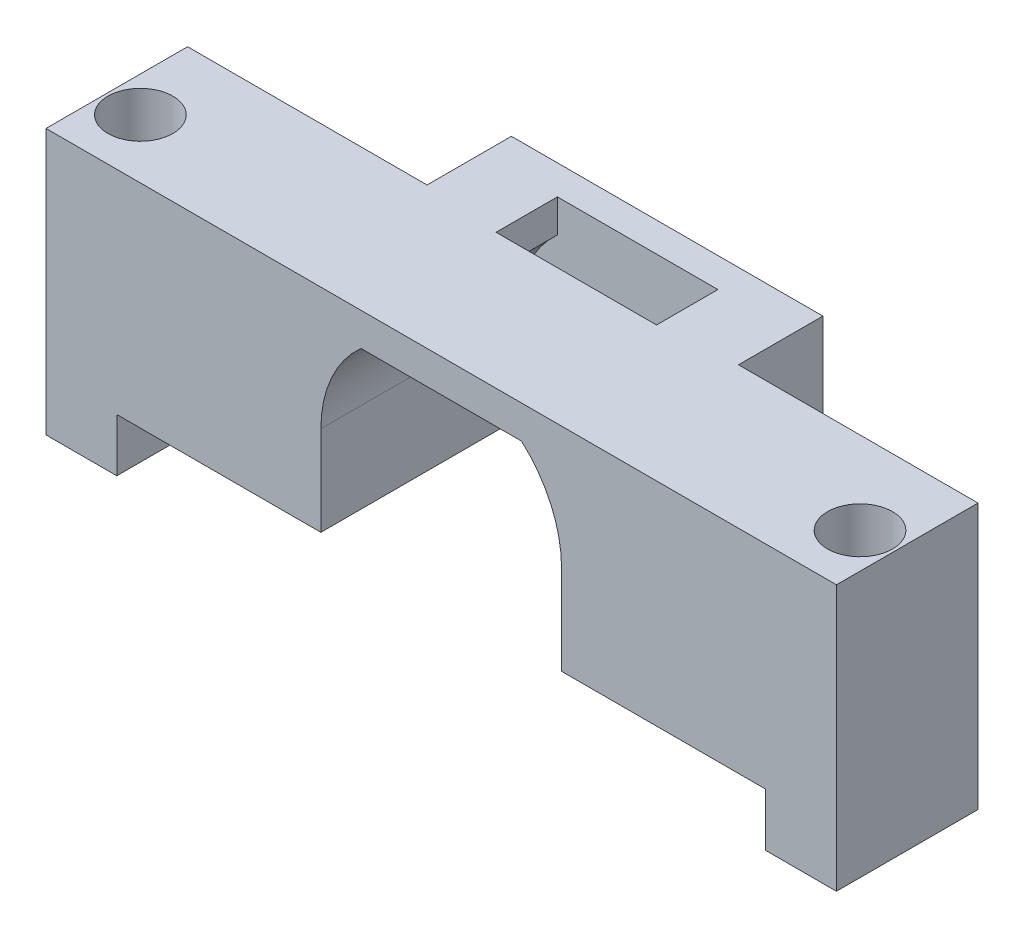
ISO-10303-21;
HEADER;
FILE_DESCRIPTION(('STEP AP214'),'2;1');
FILE_NAME('part.step','',(''),(''),'','','');
FILE_SCHEMA(('AUTOMOTIVE_DESIGN { 1 0 10303 214 1 1 1 1 }'));
ENDSEC;
DATA;
#1=APPLICATION_CONTEXT('core data for automotive mechanical design processes');
#2=APPLICATION_PROTOCOL_DEFINITION('international standard','automotive_design',2000,#1);
#3=PRODUCT_CONTEXT('',#1,'mechanical');
#4=PRODUCT('Part','Part','',(#3));
#5=PRODUCT_RELATED_PRODUCT_CATEGORY('part','',(#4));
#6=PRODUCT_DEFINITION_FORMATION('','',#4);
#7=PRODUCT_DEFINITION_CONTEXT('part definition',#1,'design');
#8=PRODUCT_DEFINITION('design','',#6,#7);
#9=PRODUCT_DEFINITION_SHAPE('','',#8);
#10=(LENGTH_UNIT() NAMED_UNIT(*) SI_UNIT(.MILLI.,.METRE.));
#11=(NAMED_UNIT(*) PLANE_ANGLE_UNIT() SI_UNIT($,.RADIAN.));
#12=(NAMED_UNIT(*) SI_UNIT($,.STERADIAN.) SOLID_ANGLE_UNIT());
#13=UNCERTAINTY_MEASURE_WITH_UNIT(LENGTH_MEASURE(1.E-05),#10,'distance_accuracy_value','');
#14=(GEOMETRIC_REPRESENTATION_CONTEXT(3) GLOBAL_UNCERTAINTY_ASSIGNED_CONTEXT((#13)) GLOBAL_UNIT_ASSIGNED_CONTEXT((#10,
#11,#12)) REPRESENTATION_CONTEXT('',''));
#15=CARTESIAN_POINT('',(0.,0.,0.));
#16=DIRECTION('',(0.,0.,1.));
#17=DIRECTION('',(1.,0.,0.));
#18=AXIS2_PLACEMENT_3D('',#15,#16,#17);
#19=CARTESIAN_POINT('',(0.,18.,12.));
#20=DIRECTION('',(0.,1.,0.));
#21=DIRECTION('',(0.,0.,1.));
#22=AXIS2_PLACEMENT_3D('',#19,#20,#21);
#23=PLANE('',#22);
#24=CARTESIAN_POINT('',(-3.,18.,7.));
#25=DIRECTION('',(0.,1.,0.));
#26=DIRECTION('',(0.,0.,1.));
#27=AXIS2_PLACEMENT_3D('',#24,#25,#26);
#28=CIRCLE('',#27,2.75);
#29=CARTESIAN_POINT('',(-3.,18.,9.75));
#30=VERTEX_POINT('',#29);
#31=EDGE_CURVE('E293',#30,#30,#28,.T.);
#32=ORIENTED_EDGE('',*,*,#31,.F.);
#33=EDGE_LOOP('',(#32));
#34=FACE_BOUND('',#33,.T.);
#35=CARTESIAN_POINT('',(58.,18.,6.99999999999999));
#36=DIRECTION('',(0.,1.,0.));
#37=DIRECTION('',(0.,0.,1.));
#38=AXIS2_PLACEMENT_3D('',#35,#36,#37);
#39=CIRCLE('',#38,2.75);
#40=CARTESIAN_POINT('',(58.,18.,9.74999999999999));
#41=VERTEX_POINT('',#40);
#42=EDGE_CURVE('E287',#41,#41,#39,.T.);
#43=ORIENTED_EDGE('',*,*,#42,.F.);
#44=EDGE_LOOP('',(#43));
#45=FACE_BOUND('',#44,.T.);
#46=DIRECTION('',(1.,0.,0.));
#47=VECTOR('',#46,1.);
#48=CARTESIAN_POINT('',(0.,18.,0.));
#49=LINE('',#48,#47);
#50=CARTESIAN_POINT('',(-6.,18.,0.));
#51=VERTEX_POINT('',#50);
#52=CARTESIAN_POINT('',(14.3,18.,0.));
#53=VERTEX_POINT('',#52);
#54=EDGE_CURVE('E479',#51,#53,#49,.T.);
#55=ORIENTED_EDGE('',*,*,#54,.F.);
#56=DIRECTION('',(0.,0.,-1.));
#57=VECTOR('',#56,1.);
#58=CARTESIAN_POINT('',(-6.,18.,0.));
#59=LINE('',#58,#57);
#60=CARTESIAN_POINT('',(-6.,18.,12.));
#61=VERTEX_POINT('',#60);
#62=EDGE_CURVE('E427',#61,#51,#59,.T.);
#63=ORIENTED_EDGE('',*,*,#62,.F.);
#64=DIRECTION('',(1.,0.,0.));
#65=VECTOR('',#64,1.);
#66=CARTESIAN_POINT('',(0.,18.,12.));
#67=LINE('',#66,#65);
#68=CARTESIAN_POINT('',(61.,18.,12.));
#69=VERTEX_POINT('',#68);
#70=EDGE_CURVE('E466',#61,#69,#67,.T.);
#71=ORIENTED_EDGE('',*,*,#70,.T.);
#72=DIRECTION('',(0.,0.,1.));
#73=VECTOR('',#72,1.);
#74=CARTESIAN_POINT('',(61.,18.,12.));
#75=LINE('',#74,#73);
#76=CARTESIAN_POINT('',(61.,18.,0.));
#77=VERTEX_POINT('',#76);
#78=EDGE_CURVE('E394',#77,#69,#75,.T.);
#79=ORIENTED_EDGE('',*,*,#78,.F.);
#80=CARTESIAN_POINT('',(40.7,18.,0.));
#81=VERTEX_POINT('',#80);
#82=EDGE_CURVE('E478',#81,#77,#49,.T.);
#83=ORIENTED_EDGE('',*,*,#82,.F.);
#84=DIRECTION('',(0.,0.,1.));
#85=VECTOR('',#84,1.);
#86=CARTESIAN_POINT('',(40.7,18.,-4.65));
#87=LINE('',#86,#85);
#88=CARTESIAN_POINT('',(40.7,18.,-7.15));
#89=VERTEX_POINT('',#88);
#90=EDGE_CURVE('E365',#89,#81,#87,.T.);
#91=ORIENTED_EDGE('',*,*,#90,.F.);
#92=DIRECTION('',(1.,0.,0.));
#93=VECTOR('',#92,1.);
#94=CARTESIAN_POINT('',(14.3,18.,-7.15));
#95=LINE('',#94,#93);
#96=CARTESIAN_POINT('',(14.3,18.,-7.15));
#97=VERTEX_POINT('',#96);
#98=EDGE_CURVE('E314',#97,#89,#95,.T.);
#99=ORIENTED_EDGE('',*,*,#98,.F.);
#100=DIRECTION('',(0.,0.,1.));
#101=VECTOR('',#100,1.);
#102=CARTESIAN_POINT('',(14.3,18.,-4.65));
#103=LINE('',#102,#101);
#104=EDGE_CURVE('E369',#97,#53,#103,.T.);
#105=ORIENTED_EDGE('',*,*,#104,.T.);
#106=EDGE_LOOP('',(#55,#63,#71,#79,#83,#91,#99,#105));
#107=FACE_BOUND('',#106,.T.);
#108=DIRECTION('',(0.,0.,-1.));
#109=VECTOR('',#108,1.);
#110=CARTESIAN_POINT('',(20.697059459322,18.,0.549999999999999));
#111=LINE('',#110,#109);
#112=CARTESIAN_POINT('',(20.697059459322,18.,0.549999999999999));
#113=VERTEX_POINT('',#112);
#114=CARTESIAN_POINT('',(20.697059459322,18.,-4.65));
#115=VERTEX_POINT('',#114);
#116=EDGE_CURVE('E219',#113,#115,#111,.T.);
#117=ORIENTED_EDGE('',*,*,#116,.T.);
#118=DIRECTION('',(-1.,0.,0.));
#119=VECTOR('',#118,1.);
#120=CARTESIAN_POINT('',(34.302940540678,18.,-4.65));
#121=LINE('',#120,#119);
#122=CARTESIAN_POINT('',(34.302940540678,18.,-4.65));
#123=VERTEX_POINT('',#122);
#124=EDGE_CURVE('E228',#123,#115,#121,.T.);
#125=ORIENTED_EDGE('',*,*,#124,.F.);
#126=DIRECTION('',(0.,0.,-1.));
#127=VECTOR('',#126,1.);
#128=CARTESIAN_POINT('',(34.302940540678,18.,0.549999999999999));
#129=LINE('',#128,#127);
#130=CARTESIAN_POINT('',(34.302940540678,18.,0.55));
#131=VERTEX_POINT('',#130);
#132=EDGE_CURVE('E238',#131,#123,#129,.T.);
#133=ORIENTED_EDGE('',*,*,#132,.F.);
#134=DIRECTION('',(-1.,0.,0.));
#135=VECTOR('',#134,1.);
#136=CARTESIAN_POINT('',(34.302940540678,18.,0.549999999999999));
#137=LINE('',#136,#135);
#138=EDGE_CURVE('E57',#131,#113,#137,.T.);
#139=ORIENTED_EDGE('',*,*,#138,.T.);
#140=EDGE_LOOP('',(#117,#125,#133,#139));
#141=FACE_BOUND('',#140,.T.);
#142=ADVANCED_FACE('F41',(#34,#45,#107,#141),#23,.T.);
#143=CARTESIAN_POINT('',(0.,0.,12.));
#144=DIRECTION('',(0.,1.,0.));
#145=DIRECTION('',(0.,0.,1.));
#146=AXIS2_PLACEMENT_3D('',#143,#144,#145);
#147=PLANE('',#146);
#148=DIRECTION('',(-1.,0.,0.));
#149=VECTOR('',#148,1.);
#150=CARTESIAN_POINT('',(40.7,0.,-7.15));
#151=LINE('',#150,#149);
#152=CARTESIAN_POINT('',(22.5946434398761,0.,-7.15));
#153=VERTEX_POINT('',#152);
#154=CARTESIAN_POINT('',(14.3,0.,-7.15));
#155=VERTEX_POINT('',#154);
#156=EDGE_CURVE('E323',#153,#155,#151,.T.);
#157=ORIENTED_EDGE('',*,*,#156,.F.);
#158=DIRECTION('',(0.,0.,-1.));
#159=VECTOR('',#158,1.);
#160=CARTESIAN_POINT('',(22.5946434398761,0.,7.47494488658952));
#161=LINE('',#160,#159);
#162=CARTESIAN_POINT('',(22.5946434398761,0.,-4.65));
#163=VERTEX_POINT('',#162);
#164=EDGE_CURVE('E260',#163,#153,#161,.T.);
#165=ORIENTED_EDGE('',*,*,#164,.F.);
#166=DIRECTION('',(-1.,0.,0.));
#167=VECTOR('',#166,1.);
#168=CARTESIAN_POINT('',(40.7,0.,-4.65));
#169=LINE('',#168,#167);
#170=CARTESIAN_POINT('',(17.3,0.,-4.65));
#171=VERTEX_POINT('',#170);
#172=EDGE_CURVE('E308',#163,#171,#169,.T.);
#173=ORIENTED_EDGE('',*,*,#172,.T.);
#174=DIRECTION('',(0.,0.,-1.));
#175=VECTOR('',#174,1.);
#176=CARTESIAN_POINT('',(17.3,0.,12.));
#177=LINE('',#176,#175);
#178=CARTESIAN_POINT('',(17.3,0.,12.));
#179=VERTEX_POINT('',#178);
#180=EDGE_CURVE('E487',#179,#171,#177,.T.);
#181=ORIENTED_EDGE('',*,*,#180,.F.);
#182=DIRECTION('',(1.,0.,0.));
#183=VECTOR('',#182,1.);
#184=CARTESIAN_POINT('',(0.,0.,12.));
#185=LINE('',#184,#183);
#186=CARTESIAN_POINT('',(0.,0.,12.));
#187=VERTEX_POINT('',#186);
#188=EDGE_CURVE('E469',#187,#179,#185,.T.);
#189=ORIENTED_EDGE('',*,*,#188,.F.);
#190=DIRECTION('',(0.,0.,-1.));
#191=VECTOR('',#190,1.);
#192=CARTESIAN_POINT('',(0.,0.,12.));
#193=LINE('',#192,#191);
#194=CARTESIAN_POINT('',(0.,0.,0.));
#195=VERTEX_POINT('',#194);
#196=EDGE_CURVE('E491',#187,#195,#193,.T.);
#197=ORIENTED_EDGE('',*,*,#196,.T.);
#198=DIRECTION('',(1.,0.,0.));
#199=VECTOR('',#198,1.);
#200=CARTESIAN_POINT('',(0.,0.,0.));
#201=LINE('',#200,#199);
#202=CARTESIAN_POINT('',(14.3,0.,0.));
#203=VERTEX_POINT('',#202);
#204=EDGE_CURVE('E453',#195,#203,#201,.T.);
#205=ORIENTED_EDGE('',*,*,#204,.T.);
#206=DIRECTION('',(0.,0.,1.));
#207=VECTOR('',#206,1.);
#208=CARTESIAN_POINT('',(14.3,0.,-4.65));
#209=LINE('',#208,#207);
#210=EDGE_CURVE('E351',#155,#203,#209,.T.);
#211=ORIENTED_EDGE('',*,*,#210,.F.);
#212=EDGE_LOOP('',(#157,#165,#173,#181,#189,#197,#205,#211));
#213=FACE_BOUND('',#212,.T.);
#214=ADVANCED_FACE('F523',(#213),#147,.F.);
#215=CARTESIAN_POINT('',(58.,-9.44974746830584,6.99999999999999));
#216=DIRECTION('',(0.,1.,0.));
#217=DIRECTION('',(0.,0.,1.));
#218=AXIS2_PLACEMENT_3D('',#215,#216,#217);
#219=CYLINDRICAL_SURFACE('',#218,1.75);
#220=CARTESIAN_POINT('',(58.,-4.5,6.99999999999999));
#221=DIRECTION('',(0.,1.,0.));
#222=DIRECTION('',(0.,0.,1.));
#223=AXIS2_PLACEMENT_3D('',#220,#221,#222);
#224=CIRCLE('',#223,1.75);
#225=CARTESIAN_POINT('',(58.,-4.5,8.75));
#226=VERTEX_POINT('',#225);
#227=EDGE_CURVE('E373',#226,#226,#224,.F.);
#228=ORIENTED_EDGE('',*,*,#227,.T.);
#229=EDGE_LOOP('',(#228));
#230=FACE_BOUND('',#229,.T.);
#231=CARTESIAN_POINT('',(58.,3.,6.99999999999999));
#232=DIRECTION('',(0.,1.,0.));
#233=DIRECTION('',(0.,0.,1.));
#234=AXIS2_PLACEMENT_3D('',#231,#232,#233);
#235=CIRCLE('',#234,1.75);
#236=CARTESIAN_POINT('',(58.,3.,8.75));
#237=VERTEX_POINT('',#236);
#238=EDGE_CURVE('E313',#237,#237,#235,.F.);
#239=ORIENTED_EDGE('',*,*,#238,.F.);
#240=EDGE_LOOP('',(#239));
#241=FACE_BOUND('',#240,.T.);
#242=ADVANCED_FACE('F520',(#230,#241),#219,.F.);
#243=CARTESIAN_POINT('',(-3.,-9.44974746830584,7.));
#244=DIRECTION('',(0.,1.,0.));
#245=DIRECTION('',(0.,0.,1.));
#246=AXIS2_PLACEMENT_3D('',#243,#244,#245);
#247=CYLINDRICAL_SURFACE('',#246,1.75);
#248=CARTESIAN_POINT('',(-3.,-4.5,7.));
#249=DIRECTION('',(0.,1.,0.));
#250=DIRECTION('',(0.,0.,1.));
#251=AXIS2_PLACEMENT_3D('',#248,#249,#250);
#252=CIRCLE('',#251,1.75);
#253=CARTESIAN_POINT('',(-3.,-4.5,8.75));
#254=VERTEX_POINT('',#253);
#255=EDGE_CURVE('E374',#254,#254,#252,.F.);
#256=ORIENTED_EDGE('',*,*,#255,.T.);
#257=EDGE_LOOP('',(#256));
#258=FACE_BOUND('',#257,.T.);
#259=CARTESIAN_POINT('',(-3.,3.,7.));
#260=DIRECTION('',(0.,1.,0.));
#261=DIRECTION('',(0.,0.,1.));
#262=AXIS2_PLACEMENT_3D('',#259,#260,#261);
#263=CIRCLE('',#262,1.75);
#264=CARTESIAN_POINT('',(-3.,3.,8.75));
#265=VERTEX_POINT('',#264);
#266=EDGE_CURVE('E292',#265,#265,#263,.F.);
#267=ORIENTED_EDGE('',*,*,#266,.F.);
#268=EDGE_LOOP('',(#267));
#269=FACE_BOUND('',#268,.T.);
#270=ADVANCED_FACE('F522',(#258,#269),#247,.F.);
#271=CARTESIAN_POINT('',(0.,0.,0.));
#272=DIRECTION('',(0.,0.,1.));
#273=DIRECTION('',(1.,0.,0.));
#274=AXIS2_PLACEMENT_3D('',#271,#272,#273);
#275=PLANE('',#274);
#276=DIRECTION('',(0.,1.,0.));
#277=VECTOR('',#276,1.);
#278=CARTESIAN_POINT('',(14.3,0.,0.));
#279=LINE('',#278,#277);
#280=EDGE_CURVE('E332',#203,#53,#279,.T.);
#281=ORIENTED_EDGE('',*,*,#280,.F.);
#282=ORIENTED_EDGE('',*,*,#204,.F.);
#283=DIRECTION('',(0.,-1.,0.));
#284=VECTOR('',#283,1.);
#285=CARTESIAN_POINT('',(0.,18.,0.));
#286=LINE('',#285,#284);
#287=CARTESIAN_POINT('',(0.,-4.5,0.));
#288=VERTEX_POINT('',#287);
#289=EDGE_CURVE('E414',#195,#288,#286,.T.);
#290=ORIENTED_EDGE('',*,*,#289,.T.);
#291=DIRECTION('',(1.,0.,0.));
#292=VECTOR('',#291,1.);
#293=CARTESIAN_POINT('',(-6.,-4.5,0.));
#294=LINE('',#293,#292);
#295=CARTESIAN_POINT('',(-6.,-4.5,0.));
#296=VERTEX_POINT('',#295);
#297=EDGE_CURVE('E443',#296,#288,#294,.T.);
#298=ORIENTED_EDGE('',*,*,#297,.F.);
#299=DIRECTION('',(0.,-1.,0.));
#300=VECTOR('',#299,1.);
#301=CARTESIAN_POINT('',(-6.,18.,0.));
#302=LINE('',#301,#300);
#303=EDGE_CURVE('E415',#51,#296,#302,.T.);
#304=ORIENTED_EDGE('',*,*,#303,.F.);
#305=ORIENTED_EDGE('',*,*,#54,.T.);
#306=EDGE_LOOP('',(#281,#282,#290,#298,#304,#305));
#307=FACE_BOUND('',#306,.T.);
#308=ADVANCED_FACE('F530',(#307),#275,.F.);
#309=DIRECTION('',(0.,-1.,0.));
#310=VECTOR('',#309,1.);
#311=CARTESIAN_POINT('',(40.7,0.,0.));
#312=LINE('',#311,#310);
#313=CARTESIAN_POINT('',(40.7,0.,0.));
#314=VERTEX_POINT('',#313);
#315=EDGE_CURVE('E341',#81,#314,#312,.T.);
#316=ORIENTED_EDGE('',*,*,#315,.F.);
#317=ORIENTED_EDGE('',*,*,#82,.T.);
#318=DIRECTION('',(0.,1.,0.));
#319=VECTOR('',#318,1.);
#320=CARTESIAN_POINT('',(61.,18.,0.));
#321=LINE('',#320,#319);
#322=CARTESIAN_POINT('',(61.,-4.5,0.));
#323=VERTEX_POINT('',#322);
#324=EDGE_CURVE('E390',#323,#77,#321,.T.);
#325=ORIENTED_EDGE('',*,*,#324,.F.);
#326=DIRECTION('',(-1.,0.,0.));
#327=VECTOR('',#326,1.);
#328=CARTESIAN_POINT('',(61.,-4.5,0.));
#329=LINE('',#328,#327);
#330=CARTESIAN_POINT('',(55.,-4.5,0.));
#331=VERTEX_POINT('',#330);
#332=EDGE_CURVE('E398',#323,#331,#329,.T.);
#333=ORIENTED_EDGE('',*,*,#332,.T.);
#334=DIRECTION('',(0.,1.,0.));
#335=VECTOR('',#334,1.);
#336=CARTESIAN_POINT('',(55.,18.,0.));
#337=LINE('',#336,#335);
#338=CARTESIAN_POINT('',(55.,0.,0.));
#339=VERTEX_POINT('',#338);
#340=EDGE_CURVE('E387',#331,#339,#337,.T.);
#341=ORIENTED_EDGE('',*,*,#340,.T.);
#342=DIRECTION('',(1.,0.,0.));
#343=VECTOR('',#342,1.);
#344=CARTESIAN_POINT('',(0.,0.,0.));
#345=LINE('',#344,#343);
#346=EDGE_CURVE('E447',#314,#339,#345,.T.);
#347=ORIENTED_EDGE('',*,*,#346,.F.);
#348=EDGE_LOOP('',(#316,#317,#325,#333,#341,#347));
#349=FACE_BOUND('',#348,.T.);
#350=ADVANCED_FACE('F559',(#349),#275,.F.);
#351=CARTESIAN_POINT('',(27.5,7.6,12.));
#352=DIRECTION('',(0.,0.,-1.));
#353=DIRECTION('',(-1.,0.,0.));
#354=AXIS2_PLACEMENT_3D('',#351,#352,#353);
#355=CYLINDRICAL_SURFACE('',#354,10.2);
#356=DIRECTION('',(0.,0.,-1.));
#357=VECTOR('',#356,1.);
#358=CARTESIAN_POINT('',(17.3,7.6,12.));
#359=LINE('',#358,#357);
#360=CARTESIAN_POINT('',(17.3,7.6,12.));
#361=VERTEX_POINT('',#360);
#362=CARTESIAN_POINT('',(17.3,7.6,-4.65));
#363=VERTEX_POINT('',#362);
#364=EDGE_CURVE('E475',#361,#363,#359,.T.);
#365=ORIENTED_EDGE('',*,*,#364,.T.);
#366=CARTESIAN_POINT('',(27.5,7.6,-4.65));
#367=DIRECTION('',(0.,0.,1.));
#368=DIRECTION('',(1.,0.,0.));
#369=AXIS2_PLACEMENT_3D('',#366,#367,#368);
#370=CIRCLE('',#369,10.2);
#371=CARTESIAN_POINT('',(20.697059459322,15.2,-4.65));
#372=VERTEX_POINT('',#371);
#373=EDGE_CURVE('E344',#372,#363,#370,.T.);
#374=ORIENTED_EDGE('',*,*,#373,.F.);
#375=DIRECTION('',(0.,0.,-1.));
#376=VECTOR('',#375,1.);
#377=CARTESIAN_POINT('',(20.697059459322,15.2,0.549999999999999));
#378=LINE('',#377,#376);
#379=CARTESIAN_POINT('',(20.697059459322,15.2,0.549999999999999));
#380=VERTEX_POINT('',#379);
#381=EDGE_CURVE('E221',#380,#372,#378,.T.);
#382=ORIENTED_EDGE('',*,*,#381,.F.);
#383=DIRECTION('',(0.,0.,-1.));
#384=VECTOR('',#383,1.);
#385=CARTESIAN_POINT('',(20.697059459322,15.2,12.));
#386=LINE('',#385,#384);
#387=CARTESIAN_POINT('',(20.697059459322,15.2,12.));
#388=VERTEX_POINT('',#387);
#389=EDGE_CURVE('E50',#388,#380,#386,.T.);
#390=ORIENTED_EDGE('',*,*,#389,.F.);
#391=CARTESIAN_POINT('',(27.5,7.6,12.));
#392=DIRECTION('',(0.,0.,1.));
#393=DIRECTION('',(1.,0.,0.));
#394=AXIS2_PLACEMENT_3D('',#391,#392,#393);
#395=CIRCLE('',#394,10.2);
#396=EDGE_CURVE('E448',#388,#361,#395,.T.);
#397=ORIENTED_EDGE('',*,*,#396,.T.);
#398=EDGE_LOOP('',(#365,#374,#382,#390,#397));
#399=FACE_BOUND('',#398,.T.);
#400=ADVANCED_FACE('F43',(#399),#355,.F.);
#401=CARTESIAN_POINT('',(0.,15.2,12.));
#402=DIRECTION('',(0.,1.,0.));
#403=DIRECTION('',(0.,0.,1.));
#404=AXIS2_PLACEMENT_3D('',#401,#402,#403);
#405=PLANE('',#404);
#406=ORIENTED_EDGE('',*,*,#389,.T.);
#407=DIRECTION('',(-1.,0.,0.));
#408=VECTOR('',#407,1.);
#409=CARTESIAN_POINT('',(34.302940540678,15.2,0.549999999999999));
#410=LINE('',#409,#408);
#411=CARTESIAN_POINT('',(34.302940540678,15.2,0.549999999999999));
#412=VERTEX_POINT('',#411);
#413=EDGE_CURVE('E565',#412,#380,#410,.T.);
#414=ORIENTED_EDGE('',*,*,#413,.F.);
#415=DIRECTION('',(0.,0.,-1.));
#416=VECTOR('',#415,1.);
#417=CARTESIAN_POINT('',(34.302940540678,15.2,12.));
#418=LINE('',#417,#416);
#419=CARTESIAN_POINT('',(34.302940540678,15.2,12.));
#420=VERTEX_POINT('',#419);
#421=EDGE_CURVE('E505',#420,#412,#418,.T.);
#422=ORIENTED_EDGE('',*,*,#421,.F.);
#423=DIRECTION('',(1.,0.,0.));
#424=VECTOR('',#423,1.);
#425=CARTESIAN_POINT('',(0.,15.2,12.));
#426=LINE('',#425,#424);
#427=EDGE_CURVE('E452',#388,#420,#426,.T.);
#428=ORIENTED_EDGE('',*,*,#427,.F.);
#429=EDGE_LOOP('',(#406,#414,#422,#428));
#430=FACE_BOUND('',#429,.T.);
#431=ADVANCED_FACE('F552',(#430),#405,.F.);
#432=CARTESIAN_POINT('',(27.5,7.6,12.));
#433=DIRECTION('',(0.,0.,-1.));
#434=DIRECTION('',(-1.,0.,0.));
#435=AXIS2_PLACEMENT_3D('',#432,#433,#434);
#436=CYLINDRICAL_SURFACE('',#435,10.2);
#437=CARTESIAN_POINT('',(27.5,7.6,-4.65));
#438=DIRECTION('',(0.,0.,1.));
#439=DIRECTION('',(-1.,0.,0.));
#440=AXIS2_PLACEMENT_3D('',#437,#438,#439);
#441=CIRCLE('',#440,10.2);
#442=CARTESIAN_POINT('',(37.7,7.6,-4.65));
#443=VERTEX_POINT('',#442);
#444=CARTESIAN_POINT('',(34.302940540678,15.2,-4.65));
#445=VERTEX_POINT('',#444);
#446=EDGE_CURVE('E340',#443,#445,#441,.T.);
#447=ORIENTED_EDGE('',*,*,#446,.F.);
#448=DIRECTION('',(0.,0.,-1.));
#449=VECTOR('',#448,1.);
#450=CARTESIAN_POINT('',(37.7,7.6,12.));
#451=LINE('',#450,#449);
#452=CARTESIAN_POINT('',(37.7,7.6,12.));
#453=VERTEX_POINT('',#452);
#454=EDGE_CURVE('E502',#453,#443,#451,.T.);
#455=ORIENTED_EDGE('',*,*,#454,.F.);
#456=CARTESIAN_POINT('',(27.5,7.6,12.));
#457=DIRECTION('',(0.,0.,1.));
#458=DIRECTION('',(1.,0.,0.));
#459=AXIS2_PLACEMENT_3D('',#456,#457,#458);
#460=CIRCLE('',#459,10.2);
#461=EDGE_CURVE('E456',#453,#420,#460,.T.);
#462=ORIENTED_EDGE('',*,*,#461,.T.);
#463=ORIENTED_EDGE('',*,*,#421,.T.);
#464=DIRECTION('',(0.,0.,-1.));
#465=VECTOR('',#464,1.);
#466=CARTESIAN_POINT('',(34.302940540678,15.2,0.549999999999999));
#467=LINE('',#466,#465);
#468=EDGE_CURVE('E254',#412,#445,#467,.T.);
#469=ORIENTED_EDGE('',*,*,#468,.T.);
#470=EDGE_LOOP('',(#447,#455,#462,#463,#469));
#471=FACE_BOUND('',#470,.T.);
#472=ADVANCED_FACE('F549',(#471),#436,.F.);
#473=CARTESIAN_POINT('',(37.7,0.,12.));
#474=DIRECTION('',(1.,0.,0.));
#475=DIRECTION('',(0.,0.,-1.));
#476=AXIS2_PLACEMENT_3D('',#473,#474,#475);
#477=PLANE('',#476);
#478=ORIENTED_EDGE('',*,*,#454,.T.);
#479=DIRECTION('',(0.,1.,0.));
#480=VECTOR('',#479,1.);
#481=CARTESIAN_POINT('',(37.7,6.,-4.65));
#482=LINE('',#481,#480);
#483=CARTESIAN_POINT('',(37.7,0.,-4.65));
#484=VERTEX_POINT('',#483);
#485=EDGE_CURVE('E336',#484,#443,#482,.T.);
#486=ORIENTED_EDGE('',*,*,#485,.F.);
#487=DIRECTION('',(0.,0.,-1.));
#488=VECTOR('',#487,1.);
#489=CARTESIAN_POINT('',(37.7,0.,12.));
#490=LINE('',#489,#488);
#491=CARTESIAN_POINT('',(37.7,0.,12.));
#492=VERTEX_POINT('',#491);
#493=EDGE_CURVE('E499',#492,#484,#490,.T.);
#494=ORIENTED_EDGE('',*,*,#493,.F.);
#495=DIRECTION('',(0.,-1.,0.));
#496=VECTOR('',#495,1.);
#497=CARTESIAN_POINT('',(37.7,0.,12.));
#498=LINE('',#497,#496);
#499=EDGE_CURVE('E460',#453,#492,#498,.T.);
#500=ORIENTED_EDGE('',*,*,#499,.F.);
#501=EDGE_LOOP('',(#478,#486,#494,#500));
#502=FACE_BOUND('',#501,.T.);
#503=ADVANCED_FACE('F546',(#502),#477,.F.);
#504=CARTESIAN_POINT('',(32.425,0.,-4.65));
#505=VERTEX_POINT('',#504);
#506=EDGE_CURVE('E319',#484,#505,#169,.T.);
#507=ORIENTED_EDGE('',*,*,#506,.T.);
#508=DIRECTION('',(0.,0.,-1.));
#509=VECTOR('',#508,1.);
#510=CARTESIAN_POINT('',(32.425,0.,7.47494488658952));
#511=LINE('',#510,#509);
#512=CARTESIAN_POINT('',(32.425,0.,-7.15));
#513=VERTEX_POINT('',#512);
#514=EDGE_CURVE('E274',#505,#513,#511,.T.);
#515=ORIENTED_EDGE('',*,*,#514,.T.);
#516=CARTESIAN_POINT('',(40.7,0.,-7.15));
#517=VERTEX_POINT('',#516);
#518=EDGE_CURVE('E324',#517,#513,#151,.T.);
#519=ORIENTED_EDGE('',*,*,#518,.F.);
#520=DIRECTION('',(0.,0.,1.));
#521=VECTOR('',#520,1.);
#522=CARTESIAN_POINT('',(40.7,0.,-4.65));
#523=LINE('',#522,#521);
#524=EDGE_CURVE('E361',#517,#314,#523,.T.);
#525=ORIENTED_EDGE('',*,*,#524,.T.);
#526=ORIENTED_EDGE('',*,*,#346,.T.);
#527=DIRECTION('',(0.,0.,-1.));
#528=VECTOR('',#527,1.);
#529=CARTESIAN_POINT('',(55.,0.,12.));
#530=LINE('',#529,#528);
#531=CARTESIAN_POINT('',(55.,0.,12.));
#532=VERTEX_POINT('',#531);
#533=EDGE_CURVE('E495',#532,#339,#530,.T.);
#534=ORIENTED_EDGE('',*,*,#533,.F.);
#535=DIRECTION('',(1.,0.,0.));
#536=VECTOR('',#535,1.);
#537=CARTESIAN_POINT('',(0.,0.,12.));
#538=LINE('',#537,#536);
#539=EDGE_CURVE('E463',#492,#532,#538,.T.);
#540=ORIENTED_EDGE('',*,*,#539,.F.);
#541=ORIENTED_EDGE('',*,*,#493,.T.);
#542=EDGE_LOOP('',(#507,#515,#519,#525,#526,#534,#540,#541));
#543=FACE_BOUND('',#542,.T.);
#544=ADVANCED_FACE('F535',(#543),#147,.F.);
#545=CARTESIAN_POINT('',(17.3,0.,12.));
#546=DIRECTION('',(-1.,0.,0.));
#547=DIRECTION('',(0.,-1.,0.));
#548=AXIS2_PLACEMENT_3D('',#545,#546,#547);
#549=PLANE('',#548);
#550=DIRECTION('',(0.,-1.,0.));
#551=VECTOR('',#550,1.);
#552=CARTESIAN_POINT('',(17.3,6.,-4.65));
#553=LINE('',#552,#551);
#554=EDGE_CURVE('E347',#363,#171,#553,.T.);
#555=ORIENTED_EDGE('',*,*,#554,.F.);
#556=ORIENTED_EDGE('',*,*,#364,.F.);
#557=DIRECTION('',(0.,1.,0.));
#558=VECTOR('',#557,1.);
#559=CARTESIAN_POINT('',(17.3,0.,12.));
#560=LINE('',#559,#558);
#561=EDGE_CURVE('E472',#179,#361,#560,.T.);
#562=ORIENTED_EDGE('',*,*,#561,.F.);
#563=ORIENTED_EDGE('',*,*,#180,.T.);
#564=EDGE_LOOP('',(#555,#556,#562,#563));
#565=FACE_BOUND('',#564,.T.);
#566=ADVANCED_FACE('F591',(#565),#549,.F.);
#567=CARTESIAN_POINT('',(0.,0.,12.));
#568=DIRECTION('',(0.,0.,1.));
#569=DIRECTION('',(1.,0.,0.));
#570=AXIS2_PLACEMENT_3D('',#567,#568,#569);
#571=PLANE('',#570);
#572=ORIENTED_EDGE('',*,*,#396,.F.);
#573=ORIENTED_EDGE('',*,*,#427,.T.);
#574=ORIENTED_EDGE('',*,*,#461,.F.);
#575=ORIENTED_EDGE('',*,*,#499,.T.);
#576=ORIENTED_EDGE('',*,*,#539,.T.);
#577=DIRECTION('',(0.,-1.,0.));
#578=VECTOR('',#577,1.);
#579=CARTESIAN_POINT('',(55.,18.,12.));
#580=LINE('',#579,#578);
#581=CARTESIAN_POINT('',(55.,-4.5,12.));
#582=VERTEX_POINT('',#581);
#583=EDGE_CURVE('E378',#532,#582,#580,.T.);
#584=ORIENTED_EDGE('',*,*,#583,.T.);
#585=DIRECTION('',(-1.,0.,0.));
#586=VECTOR('',#585,1.);
#587=CARTESIAN_POINT('',(61.,-4.5,12.));
#588=LINE('',#587,#586);
#589=CARTESIAN_POINT('',(61.,-4.5,12.));
#590=VERTEX_POINT('',#589);
#591=EDGE_CURVE('E410',#590,#582,#588,.T.);
#592=ORIENTED_EDGE('',*,*,#591,.F.);
#593=DIRECTION('',(0.,-1.,0.));
#594=VECTOR('',#593,1.);
#595=CARTESIAN_POINT('',(61.,18.,12.));
#596=LINE('',#595,#594);
#597=EDGE_CURVE('E382',#69,#590,#596,.T.);
#598=ORIENTED_EDGE('',*,*,#597,.F.);
#599=ORIENTED_EDGE('',*,*,#70,.F.);
#600=DIRECTION('',(0.,1.,0.));
#601=VECTOR('',#600,1.);
#602=CARTESIAN_POINT('',(-6.,18.,12.));
#603=LINE('',#602,#601);
#604=CARTESIAN_POINT('',(-6.,-4.5,12.));
#605=VERTEX_POINT('',#604);
#606=EDGE_CURVE('E423',#605,#61,#603,.T.);
#607=ORIENTED_EDGE('',*,*,#606,.F.);
#608=DIRECTION('',(1.,0.,0.));
#609=VECTOR('',#608,1.);
#610=CARTESIAN_POINT('',(-6.,-4.5,12.));
#611=LINE('',#610,#609);
#612=CARTESIAN_POINT('',(0.,-4.5,12.));
#613=VERTEX_POINT('',#612);
#614=EDGE_CURVE('E431',#605,#613,#611,.T.);
#615=ORIENTED_EDGE('',*,*,#614,.T.);
#616=DIRECTION('',(0.,1.,0.));
#617=VECTOR('',#616,1.);
#618=CARTESIAN_POINT('',(0.,18.,12.));
#619=LINE('',#618,#617);
#620=EDGE_CURVE('E420',#613,#187,#619,.T.);
#621=ORIENTED_EDGE('',*,*,#620,.T.);
#622=ORIENTED_EDGE('',*,*,#188,.T.);
#623=ORIENTED_EDGE('',*,*,#561,.T.);
#624=EDGE_LOOP('',(#572,#573,#574,#575,#576,#584,#592,#598,#599,#607,#615,#621,#622,#623));
#625=FACE_BOUND('',#624,.T.);
#626=ADVANCED_FACE('F584',(#625),#571,.T.);
#627=CARTESIAN_POINT('',(-6.,-4.5,0.));
#628=DIRECTION('',(0.,1.,0.));
#629=DIRECTION('',(0.,0.,1.));
#630=AXIS2_PLACEMENT_3D('',#627,#628,#629);
#631=PLANE('',#630);
#632=ORIENTED_EDGE('',*,*,#255,.F.);
#633=EDGE_LOOP('',(#632));
#634=FACE_BOUND('',#633,.T.);
#635=DIRECTION('',(0.,0.,1.));
#636=VECTOR('',#635,1.);
#637=CARTESIAN_POINT('',(0.,-4.5,0.));
#638=LINE('',#637,#636);
#639=EDGE_CURVE('E434',#288,#613,#638,.T.);
#640=ORIENTED_EDGE('',*,*,#639,.T.);
#641=ORIENTED_EDGE('',*,*,#614,.F.);
#642=DIRECTION('',(0.,0.,1.));
#643=VECTOR('',#642,1.);
#644=CARTESIAN_POINT('',(-6.,-4.5,0.));
#645=LINE('',#644,#643);
#646=EDGE_CURVE('E419',#296,#605,#645,.T.);
#647=ORIENTED_EDGE('',*,*,#646,.F.);
#648=ORIENTED_EDGE('',*,*,#297,.T.);
#649=EDGE_LOOP('',(#640,#641,#647,#648));
#650=FACE_BOUND('',#649,.T.);
#651=ADVANCED_FACE('F616',(#634,#650),#631,.F.);
#652=CARTESIAN_POINT('',(-6.,0.,0.));
#653=DIRECTION('',(-1.,0.,0.));
#654=DIRECTION('',(0.,0.,1.));
#655=AXIS2_PLACEMENT_3D('',#652,#653,#654);
#656=PLANE('',#655);
#657=ORIENTED_EDGE('',*,*,#303,.T.);
#658=ORIENTED_EDGE('',*,*,#646,.T.);
#659=ORIENTED_EDGE('',*,*,#606,.T.);
#660=ORIENTED_EDGE('',*,*,#62,.T.);
#661=EDGE_LOOP('',(#657,#658,#659,#660));
#662=FACE_BOUND('',#661,.T.);
#663=ADVANCED_FACE('F611',(#662),#656,.T.);
#664=CARTESIAN_POINT('',(0.,0.,0.));
#665=DIRECTION('',(-1.,0.,0.));
#666=DIRECTION('',(0.,0.,1.));
#667=AXIS2_PLACEMENT_3D('',#664,#665,#666);
#668=PLANE('',#667);
#669=ORIENTED_EDGE('',*,*,#196,.F.);
#670=ORIENTED_EDGE('',*,*,#620,.F.);
#671=ORIENTED_EDGE('',*,*,#639,.F.);
#672=ORIENTED_EDGE('',*,*,#289,.F.);
#673=EDGE_LOOP('',(#669,#670,#671,#672));
#674=FACE_BOUND('',#673,.T.);
#675=ADVANCED_FACE('F620',(#674),#668,.F.);
#676=CARTESIAN_POINT('',(55.,0.,0.));
#677=DIRECTION('',(1.,0.,0.));
#678=DIRECTION('',(0.,0.,-1.));
#679=AXIS2_PLACEMENT_3D('',#676,#677,#678);
#680=PLANE('',#679);
#681=ORIENTED_EDGE('',*,*,#583,.F.);
#682=ORIENTED_EDGE('',*,*,#533,.T.);
#683=ORIENTED_EDGE('',*,*,#340,.F.);
#684=DIRECTION('',(0.,0.,-1.));
#685=VECTOR('',#684,1.);
#686=CARTESIAN_POINT('',(55.,-4.5,12.));
#687=LINE('',#686,#685);
#688=EDGE_CURVE('E401',#582,#331,#687,.T.);
#689=ORIENTED_EDGE('',*,*,#688,.F.);
#690=EDGE_LOOP('',(#681,#682,#683,#689));
#691=FACE_BOUND('',#690,.T.);
#692=ADVANCED_FACE('F646',(#691),#680,.F.);
#693=CARTESIAN_POINT('',(61.,-4.5,12.));
#694=DIRECTION('',(0.,1.,0.));
#695=DIRECTION('',(0.,0.,1.));
#696=AXIS2_PLACEMENT_3D('',#693,#694,#695);
#697=PLANE('',#696);
#698=ORIENTED_EDGE('',*,*,#227,.F.);
#699=EDGE_LOOP('',(#698));
#700=FACE_BOUND('',#699,.T.);
#701=ORIENTED_EDGE('',*,*,#688,.T.);
#702=ORIENTED_EDGE('',*,*,#332,.F.);
#703=DIRECTION('',(0.,0.,-1.));
#704=VECTOR('',#703,1.);
#705=CARTESIAN_POINT('',(61.,-4.5,12.));
#706=LINE('',#705,#704);
#707=EDGE_CURVE('E386',#590,#323,#706,.T.);
#708=ORIENTED_EDGE('',*,*,#707,.F.);
#709=ORIENTED_EDGE('',*,*,#591,.T.);
#710=EDGE_LOOP('',(#701,#702,#708,#709));
#711=FACE_BOUND('',#710,.T.);
#712=ADVANCED_FACE('F648',(#700,#711),#697,.F.);
#713=CARTESIAN_POINT('',(61.,0.,0.));
#714=DIRECTION('',(1.,0.,0.));
#715=DIRECTION('',(0.,0.,-1.));
#716=AXIS2_PLACEMENT_3D('',#713,#714,#715);
#717=PLANE('',#716);
#718=ORIENTED_EDGE('',*,*,#597,.T.);
#719=ORIENTED_EDGE('',*,*,#707,.T.);
#720=ORIENTED_EDGE('',*,*,#324,.T.);
#721=ORIENTED_EDGE('',*,*,#78,.T.);
#722=EDGE_LOOP('',(#718,#719,#720,#721));
#723=FACE_BOUND('',#722,.T.);
#724=ADVANCED_FACE('F604',(#723),#717,.T.);
#725=CARTESIAN_POINT('',(14.3,0.,-4.65));
#726=DIRECTION('',(1.,0.,0.));
#727=DIRECTION('',(0.,0.,-1.));
#728=AXIS2_PLACEMENT_3D('',#725,#726,#727);
#729=PLANE('',#728);
#730=ORIENTED_EDGE('',*,*,#280,.T.);
#731=ORIENTED_EDGE('',*,*,#104,.F.);
#732=DIRECTION('',(0.,1.,0.));
#733=VECTOR('',#732,1.);
#734=CARTESIAN_POINT('',(14.3,0.,-7.15));
#735=LINE('',#734,#733);
#736=EDGE_CURVE('E328',#155,#97,#735,.T.);
#737=ORIENTED_EDGE('',*,*,#736,.F.);
#738=ORIENTED_EDGE('',*,*,#210,.T.);
#739=EDGE_LOOP('',(#730,#731,#737,#738));
#740=FACE_BOUND('',#739,.T.);
#741=ADVANCED_FACE('F626',(#740),#729,.F.);
#742=CARTESIAN_POINT('',(40.7,0.,-4.65));
#743=DIRECTION('',(-1.,0.,0.));
#744=DIRECTION('',(0.,0.,1.));
#745=AXIS2_PLACEMENT_3D('',#742,#743,#744);
#746=PLANE('',#745);
#747=ORIENTED_EDGE('',*,*,#315,.T.);
#748=ORIENTED_EDGE('',*,*,#524,.F.);
#749=DIRECTION('',(0.,-1.,0.));
#750=VECTOR('',#749,1.);
#751=CARTESIAN_POINT('',(40.7,18.,-7.15));
#752=LINE('',#751,#750);
#753=EDGE_CURVE('E318',#89,#517,#752,.T.);
#754=ORIENTED_EDGE('',*,*,#753,.F.);
#755=ORIENTED_EDGE('',*,*,#90,.T.);
#756=EDGE_LOOP('',(#747,#748,#754,#755));
#757=FACE_BOUND('',#756,.T.);
#758=ADVANCED_FACE('F650',(#757),#746,.F.);
#759=CARTESIAN_POINT('',(0.,0.,-4.65));
#760=DIRECTION('',(0.,0.,-1.));
#761=DIRECTION('',(-1.,0.,0.));
#762=AXIS2_PLACEMENT_3D('',#759,#760,#761);
#763=PLANE('',#762);
#764=ORIENTED_EDGE('',*,*,#172,.F.);
#765=DIRECTION('',(0.,-1.,0.));
#766=VECTOR('',#765,1.);
#767=CARTESIAN_POINT('',(22.5946434398761,7.09777277768608,-4.65));
#768=LINE('',#767,#766);
#769=CARTESIAN_POINT('',(22.5946434398761,7.09777277768608,-4.65));
#770=VERTEX_POINT('',#769);
#771=EDGE_CURVE('E259',#770,#163,#768,.T.);
#772=ORIENTED_EDGE('',*,*,#771,.F.);
#773=CARTESIAN_POINT('',(27.5,7.53720652473903,-4.65));
#774=DIRECTION('',(0.,0.,-1.));
#775=DIRECTION('',(-1.,0.,0.));
#776=AXIS2_PLACEMENT_3D('',#773,#774,#775);
#777=CIRCLE('',#776,4.925);
#778=CARTESIAN_POINT('',(32.4053565601239,7.09777277768608,-4.65));
#779=VERTEX_POINT('',#778);
#780=EDGE_CURVE('E309',#770,#779,#777,.T.);
#781=ORIENTED_EDGE('',*,*,#780,.T.);
#782=DIRECTION('',(-1.,0.,0.));
#783=VECTOR('',#782,1.);
#784=CARTESIAN_POINT('',(22.5946434398761,7.09777277768608,-4.65));
#785=LINE('',#784,#783);
#786=CARTESIAN_POINT('',(32.425,7.09777277768608,-4.65));
#787=VERTEX_POINT('',#786);
#788=EDGE_CURVE('E64',#787,#779,#785,.T.);
#789=ORIENTED_EDGE('',*,*,#788,.F.);
#790=DIRECTION('',(0.,1.,0.));
#791=VECTOR('',#790,1.);
#792=CARTESIAN_POINT('',(32.425,7.09777277768608,-4.65));
#793=LINE('',#792,#791);
#794=EDGE_CURVE('E256',#505,#787,#793,.T.);
#795=ORIENTED_EDGE('',*,*,#794,.F.);
#796=ORIENTED_EDGE('',*,*,#506,.F.);
#797=ORIENTED_EDGE('',*,*,#485,.T.);
#798=ORIENTED_EDGE('',*,*,#446,.T.);
#799=DIRECTION('',(0.,-1.,0.));
#800=VECTOR('',#799,1.);
#801=CARTESIAN_POINT('',(34.302940540678,32.5657131648265,-4.65));
#802=LINE('',#801,#800);
#803=EDGE_CURVE('E232',#123,#445,#802,.T.);
#804=ORIENTED_EDGE('',*,*,#803,.F.);
#805=ORIENTED_EDGE('',*,*,#124,.T.);
#806=DIRECTION('',(0.,-1.,0.));
#807=VECTOR('',#806,1.);
#808=CARTESIAN_POINT('',(20.697059459322,32.5657131648265,-4.65));
#809=LINE('',#808,#807);
#810=EDGE_CURVE('E215',#115,#372,#809,.T.);
#811=ORIENTED_EDGE('',*,*,#810,.T.);
#812=ORIENTED_EDGE('',*,*,#373,.T.);
#813=ORIENTED_EDGE('',*,*,#554,.T.);
#814=EDGE_LOOP('',(#764,#772,#781,#789,#795,#796,#797,#798,#804,#805,#811,#812,#813));
#815=FACE_BOUND('',#814,.T.);
#816=ADVANCED_FACE('F230',(#815),#763,.F.);
#817=CARTESIAN_POINT('',(0.,0.,-7.15));
#818=DIRECTION('',(0.,0.,-1.));
#819=DIRECTION('',(-1.,0.,0.));
#820=AXIS2_PLACEMENT_3D('',#817,#818,#819);
#821=PLANE('',#820);
#822=DIRECTION('',(0.,1.,0.));
#823=VECTOR('',#822,1.);
#824=CARTESIAN_POINT('',(22.5946434398761,7.09777277768608,-7.15));
#825=LINE('',#824,#823);
#826=CARTESIAN_POINT('',(22.5946434398761,7.09777277768608,-7.15));
#827=VERTEX_POINT('',#826);
#828=EDGE_CURVE('E237',#153,#827,#825,.T.);
#829=ORIENTED_EDGE('',*,*,#828,.F.);
#830=ORIENTED_EDGE('',*,*,#156,.T.);
#831=ORIENTED_EDGE('',*,*,#736,.T.);
#832=ORIENTED_EDGE('',*,*,#98,.T.);
#833=ORIENTED_EDGE('',*,*,#753,.T.);
#834=ORIENTED_EDGE('',*,*,#518,.T.);
#835=DIRECTION('',(0.,-1.,0.));
#836=VECTOR('',#835,1.);
#837=CARTESIAN_POINT('',(32.425,7.09777277768608,-7.15));
#838=LINE('',#837,#836);
#839=CARTESIAN_POINT('',(32.425,7.09777277768608,-7.15));
#840=VERTEX_POINT('',#839);
#841=EDGE_CURVE('E268',#840,#513,#838,.T.);
#842=ORIENTED_EDGE('',*,*,#841,.F.);
#843=DIRECTION('',(1.,0.,0.));
#844=VECTOR('',#843,1.);
#845=CARTESIAN_POINT('',(22.5946434398761,7.09777277768608,-7.15));
#846=LINE('',#845,#844);
#847=CARTESIAN_POINT('',(32.4053565601239,7.09777277768608,-7.15));
#848=VERTEX_POINT('',#847);
#849=EDGE_CURVE('E265',#848,#840,#846,.T.);
#850=ORIENTED_EDGE('',*,*,#849,.F.);
#851=CARTESIAN_POINT('',(27.5,7.53720652473903,-7.15));
#852=DIRECTION('',(0.,0.,-1.));
#853=DIRECTION('',(-1.,0.,0.));
#854=AXIS2_PLACEMENT_3D('',#851,#852,#853);
#855=CIRCLE('',#854,4.925);
#856=EDGE_CURVE('E304',#827,#848,#855,.T.);
#857=ORIENTED_EDGE('',*,*,#856,.F.);
#858=EDGE_LOOP('',(#829,#830,#831,#832,#833,#834,#842,#850,#857));
#859=FACE_BOUND('',#858,.T.);
#860=ADVANCED_FACE('F630',(#859),#821,.T.);
#861=CARTESIAN_POINT('',(27.5,7.53720652473903,-7.15));
#862=DIRECTION('',(0.,0.,1.));
#863=DIRECTION('',(1.,0.,0.));
#864=AXIS2_PLACEMENT_3D('',#861,#862,#863);
#865=CYLINDRICAL_SURFACE('',#864,4.925);
#866=DIRECTION('',(0.,0.,-1.));
#867=VECTOR('',#866,1.);
#868=CARTESIAN_POINT('',(22.5946434398761,7.09777277768608,7.47494488658952));
#869=LINE('',#868,#867);
#870=EDGE_CURVE('E271',#770,#827,#869,.T.);
#871=ORIENTED_EDGE('',*,*,#870,.T.);
#872=ORIENTED_EDGE('',*,*,#856,.T.);
#873=DIRECTION('',(0.,0.,1.));
#874=VECTOR('',#873,1.);
#875=CARTESIAN_POINT('',(32.4053565601239,7.09777277768608,-7.15));
#876=LINE('',#875,#874);
#877=EDGE_CURVE('E11',#779,#848,#876,.F.);
#878=ORIENTED_EDGE('',*,*,#877,.F.);
#879=ORIENTED_EDGE('',*,*,#780,.F.);
#880=EDGE_LOOP('',(#871,#872,#878,#879));
#881=FACE_BOUND('',#880,.T.);
#882=ADVANCED_FACE('F637',(#881),#865,.F.);
#883=CARTESIAN_POINT('',(-3.,3.,7.));
#884=DIRECTION('',(0.,1.,0.));
#885=DIRECTION('',(0.,0.,1.));
#886=AXIS2_PLACEMENT_3D('',#883,#884,#885);
#887=PLANE('',#886);
#888=CARTESIAN_POINT('',(-3.,3.,7.));
#889=DIRECTION('',(0.,1.,0.));
#890=DIRECTION('',(0.,0.,1.));
#891=AXIS2_PLACEMENT_3D('',#888,#889,#890);
#892=CIRCLE('',#891,2.75);
#893=CARTESIAN_POINT('',(-3.,3.,9.75));
#894=VERTEX_POINT('',#893);
#895=EDGE_CURVE('E288',#894,#894,#892,.T.);
#896=ORIENTED_EDGE('',*,*,#895,.T.);
#897=EDGE_LOOP('',(#896));
#898=FACE_BOUND('',#897,.T.);
#899=ORIENTED_EDGE('',*,*,#266,.T.);
#900=EDGE_LOOP('',(#899));
#901=FACE_BOUND('',#900,.T.);
#902=ADVANCED_FACE('F669',(#898,#901),#887,.T.);
#903=CARTESIAN_POINT('',(-3.,3.,7.));
#904=DIRECTION('',(0.,1.,0.));
#905=DIRECTION('',(0.,0.,1.));
#906=AXIS2_PLACEMENT_3D('',#903,#904,#905);
#907=CYLINDRICAL_SURFACE('',#906,2.75);
#908=ORIENTED_EDGE('',*,*,#895,.F.);
#909=EDGE_LOOP('',(#908));
#910=FACE_BOUND('',#909,.T.);
#911=ORIENTED_EDGE('',*,*,#31,.T.);
#912=EDGE_LOOP('',(#911));
#913=FACE_BOUND('',#912,.T.);
#914=ADVANCED_FACE('F672',(#910,#913),#907,.F.);
#915=CARTESIAN_POINT('',(58.,3.,6.99999999999999));
#916=DIRECTION('',(0.,1.,0.));
#917=DIRECTION('',(0.,0.,1.));
#918=AXIS2_PLACEMENT_3D('',#915,#916,#917);
#919=PLANE('',#918);
#920=CARTESIAN_POINT('',(58.,3.,6.99999999999999));
#921=DIRECTION('',(0.,1.,0.));
#922=DIRECTION('',(0.,0.,1.));
#923=AXIS2_PLACEMENT_3D('',#920,#921,#922);
#924=CIRCLE('',#923,2.75);
#925=CARTESIAN_POINT('',(58.,3.,9.74999999999999));
#926=VERTEX_POINT('',#925);
#927=EDGE_CURVE('E297',#926,#926,#924,.T.);
#928=ORIENTED_EDGE('',*,*,#927,.T.);
#929=EDGE_LOOP('',(#928));
#930=FACE_BOUND('',#929,.T.);
#931=ORIENTED_EDGE('',*,*,#238,.T.);
#932=EDGE_LOOP('',(#931));
#933=FACE_BOUND('',#932,.T.);
#934=ADVANCED_FACE('F518',(#930,#933),#919,.T.);
#935=CARTESIAN_POINT('',(58.,3.,6.99999999999999));
#936=DIRECTION('',(0.,1.,0.));
#937=DIRECTION('',(0.,0.,1.));
#938=AXIS2_PLACEMENT_3D('',#935,#936,#937);
#939=CYLINDRICAL_SURFACE('',#938,2.75);
#940=ORIENTED_EDGE('',*,*,#927,.F.);
#941=EDGE_LOOP('',(#940));
#942=FACE_BOUND('',#941,.T.);
#943=ORIENTED_EDGE('',*,*,#42,.T.);
#944=EDGE_LOOP('',(#943));
#945=FACE_BOUND('',#944,.T.);
#946=ADVANCED_FACE('F656',(#942,#945),#939,.F.);
#947=CARTESIAN_POINT('',(22.5946434398761,7.09777277768608,7.47494488658952));
#948=DIRECTION('',(0.,1.,0.));
#949=DIRECTION('',(0.,0.,1.));
#950=AXIS2_PLACEMENT_3D('',#947,#948,#949);
#951=PLANE('',#950);
#952=ORIENTED_EDGE('',*,*,#877,.T.);
#953=ORIENTED_EDGE('',*,*,#849,.T.);
#954=DIRECTION('',(0.,0.,-1.));
#955=VECTOR('',#954,1.);
#956=CARTESIAN_POINT('',(32.425,7.09777277768608,7.47494488658952));
#957=LINE('',#956,#955);
#958=EDGE_CURVE('E278',#787,#840,#957,.T.);
#959=ORIENTED_EDGE('',*,*,#958,.F.);
#960=ORIENTED_EDGE('',*,*,#788,.T.);
#961=EDGE_LOOP('',(#952,#953,#959,#960));
#962=FACE_BOUND('',#961,.T.);
#963=ADVANCED_FACE('F654',(#962),#951,.F.);
#964=CARTESIAN_POINT('',(32.425,7.09777277768608,7.47494488658952));
#965=DIRECTION('',(1.,0.,0.));
#966=DIRECTION('',(0.,0.,-1.));
#967=AXIS2_PLACEMENT_3D('',#964,#965,#966);
#968=PLANE('',#967);
#969=ORIENTED_EDGE('',*,*,#794,.T.);
#970=ORIENTED_EDGE('',*,*,#958,.T.);
#971=ORIENTED_EDGE('',*,*,#841,.T.);
#972=ORIENTED_EDGE('',*,*,#514,.F.);
#973=EDGE_LOOP('',(#969,#970,#971,#972));
#974=FACE_BOUND('',#973,.T.);
#975=ADVANCED_FACE('F653',(#974),#968,.F.);
#976=CARTESIAN_POINT('',(22.5946434398761,7.09777277768608,7.47494488658952));
#977=DIRECTION('',(-1.,0.,0.));
#978=DIRECTION('',(0.,0.,1.));
#979=AXIS2_PLACEMENT_3D('',#976,#977,#978);
#980=PLANE('',#979);
#981=ORIENTED_EDGE('',*,*,#771,.T.);
#982=ORIENTED_EDGE('',*,*,#164,.T.);
#983=ORIENTED_EDGE('',*,*,#828,.T.);
#984=ORIENTED_EDGE('',*,*,#870,.F.);
#985=EDGE_LOOP('',(#981,#982,#983,#984));
#986=FACE_BOUND('',#985,.T.);
#987=ADVANCED_FACE('F635',(#986),#980,.F.);
#988=CARTESIAN_POINT('',(20.697059459322,32.5657131648265,0.549999999999999));
#989=DIRECTION('',(-1.,0.,0.));
#990=DIRECTION('',(0.,0.,1.));
#991=AXIS2_PLACEMENT_3D('',#988,#989,#990);
#992=PLANE('',#991);
#993=DIRECTION('',(0.,-1.,0.));
#994=VECTOR('',#993,1.);
#995=CARTESIAN_POINT('',(20.697059459322,32.5657131648265,0.549999999999999));
#996=LINE('',#995,#994);
#997=EDGE_CURVE('E249',#113,#380,#996,.T.);
#998=ORIENTED_EDGE('',*,*,#997,.T.);
#999=ORIENTED_EDGE('',*,*,#381,.T.);
#1000=ORIENTED_EDGE('',*,*,#810,.F.);
#1001=ORIENTED_EDGE('',*,*,#116,.F.);
#1002=EDGE_LOOP('',(#998,#999,#1000,#1001));
#1003=FACE_BOUND('',#1002,.T.);
#1004=ADVANCED_FACE('F217',(#1003),#992,.F.);
#1005=CARTESIAN_POINT('',(34.302940540678,32.5657131648265,0.549999999999999));
#1006=DIRECTION('',(0.,0.,1.));
#1007=DIRECTION('',(1.,0.,0.));
#1008=AXIS2_PLACEMENT_3D('',#1005,#1006,#1007);
#1009=PLANE('',#1008);
#1010=DIRECTION('',(0.,-1.,0.));
#1011=VECTOR('',#1010,1.);
#1012=CARTESIAN_POINT('',(34.302940540678,32.5657131648265,0.549999999999999));
#1013=LINE('',#1012,#1011);
#1014=EDGE_CURVE('E252',#131,#412,#1013,.T.);
#1015=ORIENTED_EDGE('',*,*,#1014,.T.);
#1016=ORIENTED_EDGE('',*,*,#413,.T.);
#1017=ORIENTED_EDGE('',*,*,#997,.F.);
#1018=ORIENTED_EDGE('',*,*,#138,.F.);
#1019=EDGE_LOOP('',(#1015,#1016,#1017,#1018));
#1020=FACE_BOUND('',#1019,.T.);
#1021=ADVANCED_FACE('F749',(#1020),#1009,.F.);
#1022=CARTESIAN_POINT('',(34.302940540678,32.5657131648265,0.549999999999999));
#1023=DIRECTION('',(-1.,0.,0.));
#1024=DIRECTION('',(0.,0.,1.));
#1025=AXIS2_PLACEMENT_3D('',#1022,#1023,#1024);
#1026=PLANE('',#1025);
#1027=ORIENTED_EDGE('',*,*,#132,.T.);
#1028=ORIENTED_EDGE('',*,*,#803,.T.);
#1029=ORIENTED_EDGE('',*,*,#468,.F.);
#1030=ORIENTED_EDGE('',*,*,#1014,.F.);
#1031=EDGE_LOOP('',(#1027,#1028,#1029,#1030));
#1032=FACE_BOUND('',#1031,.T.);
#1033=ADVANCED_FACE('F757',(#1032),#1026,.T.);
#1034=CLOSED_SHELL('',(#142,#214,#242,#270,#308,#350,#400,#431,#472,#503,#544,#566,#626,#651,
#663,#675,#692,#712,#724,#741,#758,#816,#860,#882,#902,#914,#934,#946,#963,#975,#987,#1004,
#1021,#1033));
#1035=MANIFOLD_SOLID_BREP('B2',#1034);
#1036=ADVANCED_BREP_SHAPE_REPRESENTATION('',(#18,#1035),#14);
#1037=SHAPE_DEFINITION_REPRESENTATION(#9,#1036);
ENDSEC;
END-ISO-10303-21;
